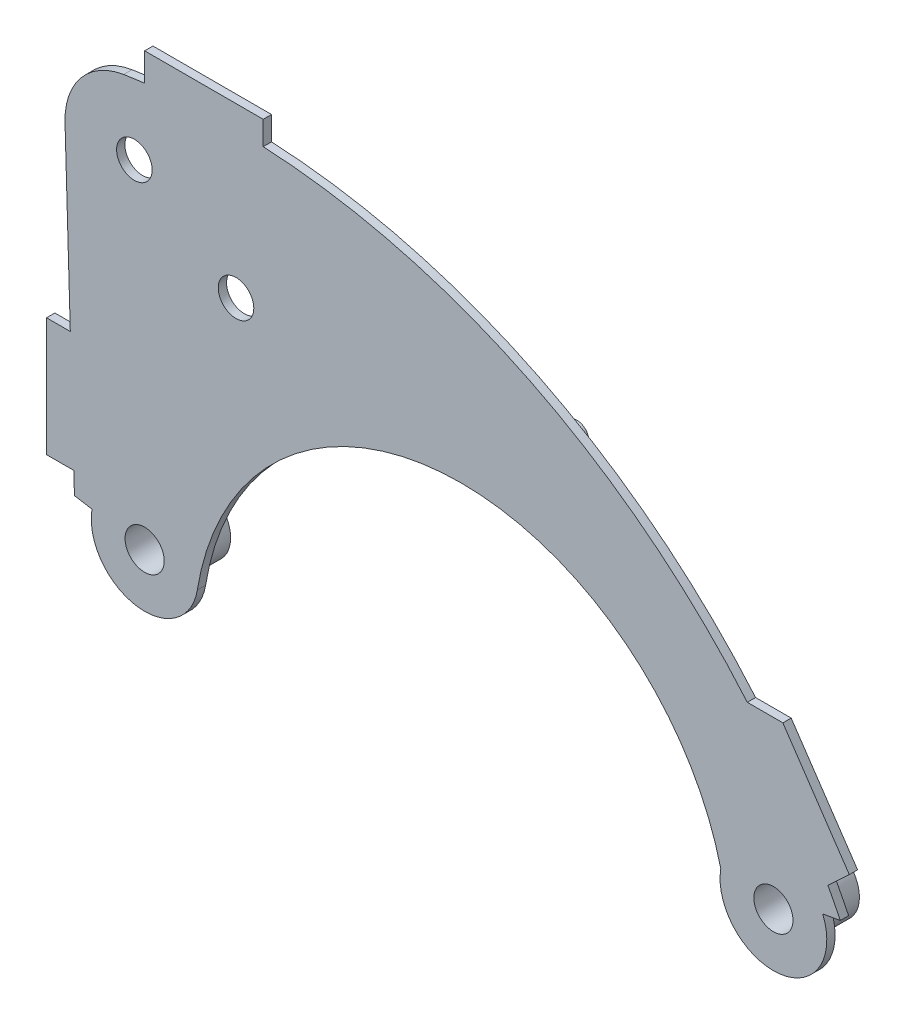
ISO-10303-21;
HEADER;
FILE_DESCRIPTION(('STEP AP214'),'2;1');
FILE_NAME('part.step','',(''),(''),'','','');
FILE_SCHEMA(('AUTOMOTIVE_DESIGN { 1 0 10303 214 1 1 1 1 }'));
ENDSEC;
DATA;
#1=APPLICATION_CONTEXT('core data for automotive mechanical design processes');
#2=APPLICATION_PROTOCOL_DEFINITION('international standard','automotive_design',2000,#1);
#3=PRODUCT_CONTEXT('',#1,'mechanical');
#4=PRODUCT('Part','Part','',(#3));
#5=PRODUCT_RELATED_PRODUCT_CATEGORY('part','',(#4));
#6=PRODUCT_DEFINITION_FORMATION('','',#4);
#7=PRODUCT_DEFINITION_CONTEXT('part definition',#1,'design');
#8=PRODUCT_DEFINITION('design','',#6,#7);
#9=PRODUCT_DEFINITION_SHAPE('','',#8);
#10=(LENGTH_UNIT() NAMED_UNIT(*) SI_UNIT(.MILLI.,.METRE.));
#11=(NAMED_UNIT(*) PLANE_ANGLE_UNIT() SI_UNIT($,.RADIAN.));
#12=(NAMED_UNIT(*) SI_UNIT($,.STERADIAN.) SOLID_ANGLE_UNIT());
#13=UNCERTAINTY_MEASURE_WITH_UNIT(LENGTH_MEASURE(1.E-05),#10,'distance_accuracy_value','');
#14=(GEOMETRIC_REPRESENTATION_CONTEXT(3) GLOBAL_UNCERTAINTY_ASSIGNED_CONTEXT((#13)) GLOBAL_UNIT_ASSIGNED_CONTEXT((#10,
#11,#12)) REPRESENTATION_CONTEXT('',''));
#15=CARTESIAN_POINT('',(0.,0.,0.));
#16=DIRECTION('',(0.,0.,1.));
#17=DIRECTION('',(1.,0.,0.));
#18=AXIS2_PLACEMENT_3D('',#15,#16,#17);
#19=CARTESIAN_POINT('',(-192.707076218779,-184.284598923351,7.));
#20=DIRECTION('',(0.,0.,-1.));
#21=DIRECTION('',(-1.,0.,0.));
#22=AXIS2_PLACEMENT_3D('',#19,#20,#21);
#23=CYLINDRICAL_SURFACE('',#22,573.469503846789);
#24=CARTESIAN_POINT('',(-192.707076218779,-184.284598923351,7.));
#25=DIRECTION('',(0.,0.,1.));
#26=DIRECTION('',(1.,0.,0.));
#27=AXIS2_PLACEMENT_3D('',#24,#25,#26);
#28=CIRCLE('',#27,573.469503846789);
#29=CARTESIAN_POINT('',(-263.634141290902,384.781849993238,7.00000000000001));
#30=VERTEX_POINT('',#29);
#31=CARTESIAN_POINT('',(-281.327086526287,382.296168148193,7.));
#32=VERTEX_POINT('',#31);
#33=EDGE_CURVE('E345',#30,#32,#28,.T.);
#34=ORIENTED_EDGE('',*,*,#33,.F.);
#35=DIRECTION('',(0.,0.,-1.));
#36=VECTOR('',#35,1.);
#37=CARTESIAN_POINT('',(-263.634141290902,384.781849993238,7.));
#38=LINE('',#37,#36);
#39=CARTESIAN_POINT('',(-263.634141290902,384.781849993238,0.));
#40=VERTEX_POINT('',#39);
#41=EDGE_CURVE('E199',#30,#40,#38,.T.);
#42=ORIENTED_EDGE('',*,*,#41,.T.);
#43=CARTESIAN_POINT('',(-192.707076218779,-184.284598923351,0.));
#44=DIRECTION('',(0.,0.,1.));
#45=DIRECTION('',(1.,0.,0.));
#46=AXIS2_PLACEMENT_3D('',#43,#44,#45);
#47=CIRCLE('',#46,573.469503846789);
#48=CARTESIAN_POINT('',(-281.327086526287,382.296168148193,0.));
#49=VERTEX_POINT('',#48);
#50=EDGE_CURVE('E391',#40,#49,#47,.T.);
#51=ORIENTED_EDGE('',*,*,#50,.T.);
#52=DIRECTION('',(0.,0.,-1.));
#53=VECTOR('',#52,1.);
#54=CARTESIAN_POINT('',(-281.327086526287,382.296168148193,7.));
#55=LINE('',#54,#53);
#56=EDGE_CURVE('E449',#32,#49,#55,.T.);
#57=ORIENTED_EDGE('',*,*,#56,.F.);
#58=EDGE_LOOP('',(#34,#42,#51,#57));
#59=FACE_BOUND('',#58,.T.);
#60=ADVANCED_FACE('F41',(#59),#23,.T.);
#61=CARTESIAN_POINT('',(-320.932430468004,-9.49371903301343,7.));
#62=DIRECTION('',(-0.999562749185393,-0.0295687409427409,0.));
#63=DIRECTION('',(0.0295687409427409,-0.999562749185393,0.));
#64=AXIS2_PLACEMENT_3D('',#61,#62,#63);
#65=PLANE('',#64);
#66=DIRECTION('',(0.,0.,-1.));
#67=VECTOR('',#66,1.);
#68=CARTESIAN_POINT('',(-323.347893363287,72.1603066436242,109.601547052196));
#69=LINE('',#68,#67);
#70=CARTESIAN_POINT('',(-323.347893363287,72.1603066436242,7.00000000000001));
#71=VERTEX_POINT('',#70);
#72=CARTESIAN_POINT('',(-323.347893363287,72.1603066436242,0.));
#73=VERTEX_POINT('',#72);
#74=EDGE_CURVE('E250',#71,#73,#69,.T.);
#75=ORIENTED_EDGE('',*,*,#74,.T.);
#76=DIRECTION('',(-0.0295687409427408,0.999562749185393,0.));
#77=VECTOR('',#76,1.);
#78=CARTESIAN_POINT('',(-320.932430468004,-9.49371903301343,0.));
#79=LINE('',#78,#77);
#80=CARTESIAN_POINT('',(-322.811275447721,54.0200929637776,0.));
#81=VERTEX_POINT('',#80);
#82=EDGE_CURVE('E401',#81,#73,#79,.T.);
#83=ORIENTED_EDGE('',*,*,#82,.F.);
#84=DIRECTION('',(0.,0.,-1.));
#85=VECTOR('',#84,1.);
#86=CARTESIAN_POINT('',(-322.811275447721,54.0200929637776,7.));
#87=LINE('',#86,#85);
#88=CARTESIAN_POINT('',(-322.811275447721,54.0200929637776,7.));
#89=VERTEX_POINT('',#88);
#90=EDGE_CURVE('E442',#89,#81,#87,.T.);
#91=ORIENTED_EDGE('',*,*,#90,.F.);
#92=DIRECTION('',(-0.0295687409427408,0.999562749185393,0.));
#93=VECTOR('',#92,1.);
#94=CARTESIAN_POINT('',(-320.932430468004,-9.49371903301343,7.));
#95=LINE('',#94,#93);
#96=EDGE_CURVE('E356',#89,#71,#95,.T.);
#97=ORIENTED_EDGE('',*,*,#96,.T.);
#98=EDGE_LOOP('',(#75,#83,#91,#97));
#99=FACE_BOUND('',#98,.T.);
#100=ADVANCED_FACE('F505',(#99),#65,.T.);
#101=CARTESIAN_POINT('',(244.528320180964,186.784774614053,0.));
#102=VERTEX_POINT('',#101);
#103=CARTESIAN_POINT('',(-163.634141290902,388.44748180634,0.));
#104=VERTEX_POINT('',#103);
#105=EDGE_CURVE('E396',#102,#104,#47,.T.);
#106=ORIENTED_EDGE('',*,*,#105,.T.);
#107=DIRECTION('',(0.,0.,-1.));
#108=VECTOR('',#107,1.);
#109=CARTESIAN_POINT('',(-163.634141290902,388.44748180634,109.904064373315));
#110=LINE('',#109,#108);
#111=CARTESIAN_POINT('',(-163.634141290901,388.44748180634,7.));
#112=VERTEX_POINT('',#111);
#113=EDGE_CURVE('E225',#112,#104,#110,.T.);
#114=ORIENTED_EDGE('',*,*,#113,.F.);
#115=CARTESIAN_POINT('',(244.528320180963,186.784774614054,7.00000000000001));
#116=VERTEX_POINT('',#115);
#117=EDGE_CURVE('E351',#116,#112,#28,.T.);
#118=ORIENTED_EDGE('',*,*,#117,.F.);
#119=DIRECTION('',(0.,0.,-1.));
#120=VECTOR('',#119,1.);
#121=CARTESIAN_POINT('',(244.528320180963,186.784774614054,138.898143616033));
#122=LINE('',#121,#120);
#123=EDGE_CURVE('E277',#116,#102,#122,.T.);
#124=ORIENTED_EDGE('',*,*,#123,.T.);
#125=EDGE_LOOP('',(#106,#114,#118,#124));
#126=FACE_BOUND('',#125,.T.);
#127=ADVANCED_FACE('F508',(#126),#23,.T.);
#128=CARTESIAN_POINT('',(-1.74396232257102,9.99269328968787,7.));
#129=DIRECTION('',(-0.171925097366177,0.985110024766589,0.));
#130=DIRECTION('',(-0.98511002476659,-0.171925097366177,0.));
#131=AXIS2_PLACEMENT_3D('',#128,#129,#130);
#132=PLANE('',#131);
#133=DIRECTION('',(0.985110024766589,0.171925097366177,0.));
#134=VECTOR('',#133,1.);
#135=CARTESIAN_POINT('',(-1.74396232257102,9.99269328968787,0.));
#136=LINE('',#135,#134);
#137=CARTESIAN_POINT('',(308.11587010362,64.0705937479262,0.));
#138=VERTEX_POINT('',#137);
#139=CARTESIAN_POINT('',(322.942948353425,66.6582710709314,0.));
#140=VERTEX_POINT('',#139);
#141=EDGE_CURVE('E387',#138,#140,#136,.T.);
#142=ORIENTED_EDGE('',*,*,#141,.T.);
#143=DIRECTION('',(0.,0.,-1.));
#144=VECTOR('',#143,1.);
#145=CARTESIAN_POINT('',(322.942948353425,66.6582710709314,7.));
#146=LINE('',#145,#144);
#147=CARTESIAN_POINT('',(322.942948353425,66.6582710709314,7.));
#148=VERTEX_POINT('',#147);
#149=EDGE_CURVE('E453',#148,#140,#146,.T.);
#150=ORIENTED_EDGE('',*,*,#149,.F.);
#151=DIRECTION('',(0.985110024766589,0.171925097366177,0.));
#152=VECTOR('',#151,1.);
#153=CARTESIAN_POINT('',(-1.74396232257102,9.99269328968787,7.));
#154=LINE('',#153,#152);
#155=CARTESIAN_POINT('',(308.11587010362,64.0705937479262,7.));
#156=VERTEX_POINT('',#155);
#157=EDGE_CURVE('E341',#156,#148,#154,.T.);
#158=ORIENTED_EDGE('',*,*,#157,.F.);
#159=DIRECTION('',(0.,0.,-1.));
#160=VECTOR('',#159,1.);
#161=CARTESIAN_POINT('',(308.11587010362,64.0705937479262,7.));
#162=LINE('',#161,#160);
#163=EDGE_CURVE('E378',#156,#138,#162,.T.);
#164=ORIENTED_EDGE('',*,*,#163,.T.);
#165=EDGE_LOOP('',(#142,#150,#158,#164));
#166=FACE_BOUND('',#165,.T.);
#167=ADVANCED_FACE('F518',(#166),#132,.F.);
#168=CARTESIAN_POINT('',(312.479281407487,87.1081347866523,0.));
#169=VERTEX_POINT('',#168);
#170=EDGE_CURVE('E392',#140,#169,#47,.T.);
#171=ORIENTED_EDGE('',*,*,#170,.T.);
#172=DIRECTION('',(0.,0.,-1.));
#173=VECTOR('',#172,1.);
#174=CARTESIAN_POINT('',(312.479281407487,87.1081347866523,7.));
#175=LINE('',#174,#173);
#176=CARTESIAN_POINT('',(312.479281407487,87.1081347866523,7.));
#177=VERTEX_POINT('',#176);
#178=EDGE_CURVE('E291',#169,#177,#175,.F.);
#179=ORIENTED_EDGE('',*,*,#178,.T.);
#180=EDGE_CURVE('E346',#148,#177,#28,.T.);
#181=ORIENTED_EDGE('',*,*,#180,.F.);
#182=ORIENTED_EDGE('',*,*,#149,.T.);
#183=EDGE_LOOP('',(#171,#179,#181,#182));
#184=FACE_BOUND('',#183,.T.);
#185=ADVANCED_FACE('F509',(#184),#23,.T.);
#186=CARTESIAN_POINT('',(-272.286901183886,324.498892702243,7.));
#187=DIRECTION('',(0.,0.,-1.));
#188=DIRECTION('',(-1.,0.,0.));
#189=AXIS2_PLACEMENT_3D('',#186,#187,#188);
#190=CYLINDRICAL_SURFACE('',#189,58.5);
#191=CARTESIAN_POINT('',(-272.286901183886,324.498892702243,0.));
#192=DIRECTION('',(0.,0.,1.));
#193=DIRECTION('',(1.,0.,0.));
#194=AXIS2_PLACEMENT_3D('',#191,#192,#193);
#195=CIRCLE('',#194,58.5);
#196=CARTESIAN_POINT('',(-330.761322011232,322.769121357092,0.));
#197=VERTEX_POINT('',#196);
#198=EDGE_CURVE('E395',#49,#197,#195,.T.);
#199=ORIENTED_EDGE('',*,*,#198,.T.);
#200=DIRECTION('',(0.,0.,-1.));
#201=VECTOR('',#200,1.);
#202=CARTESIAN_POINT('',(-330.761322011232,322.769121357092,7.));
#203=LINE('',#202,#201);
#204=CARTESIAN_POINT('',(-330.761322011232,322.769121357092,7.));
#205=VERTEX_POINT('',#204);
#206=EDGE_CURVE('E445',#205,#197,#203,.T.);
#207=ORIENTED_EDGE('',*,*,#206,.F.);
#208=CARTESIAN_POINT('',(-272.286901183886,324.498892702243,7.));
#209=DIRECTION('',(0.,0.,1.));
#210=DIRECTION('',(1.,0.,0.));
#211=AXIS2_PLACEMENT_3D('',#208,#209,#210);
#212=CIRCLE('',#211,58.5);
#213=EDGE_CURVE('E350',#32,#205,#212,.T.);
#214=ORIENTED_EDGE('',*,*,#213,.F.);
#215=ORIENTED_EDGE('',*,*,#56,.T.);
#216=EDGE_LOOP('',(#199,#207,#214,#215));
#217=FACE_BOUND('',#216,.T.);
#218=ADVANCED_FACE('F521',(#217),#190,.T.);
#219=DIRECTION('',(0.,0.,-1.));
#220=VECTOR('',#219,1.);
#221=CARTESIAN_POINT('',(-326.306060918734,172.160306643624,109.601547052196));
#222=LINE('',#221,#220);
#223=CARTESIAN_POINT('',(-326.306060918734,172.160306643624,7.00000000000001));
#224=VERTEX_POINT('',#223);
#225=CARTESIAN_POINT('',(-326.306060918734,172.160306643624,0.));
#226=VERTEX_POINT('',#225);
#227=EDGE_CURVE('E242',#224,#226,#222,.T.);
#228=ORIENTED_EDGE('',*,*,#227,.F.);
#229=EDGE_CURVE('E355',#224,#205,#95,.T.);
#230=ORIENTED_EDGE('',*,*,#229,.T.);
#231=ORIENTED_EDGE('',*,*,#206,.T.);
#232=EDGE_CURVE('E400',#226,#197,#79,.T.);
#233=ORIENTED_EDGE('',*,*,#232,.F.);
#234=EDGE_LOOP('',(#228,#230,#231,#233));
#235=FACE_BOUND('',#234,.T.);
#236=ADVANCED_FACE('F515',(#235),#65,.T.);
#237=CARTESIAN_POINT('',(-8.62227936014492E-06,-5.15246478796E-05,7.));
#238=DIRECTION('',(-0.165047798620306,-0.986285569280313,0.));
#239=DIRECTION('',(0.986285569280313,-0.165047798620306,0.));
#240=AXIS2_PLACEMENT_3D('',#237,#238,#239);
#241=PLANE('',#240);
#242=DIRECTION('',(-0.986285569280313,0.165047798620306,0.));
#243=VECTOR('',#242,1.);
#244=CARTESIAN_POINT('',(-8.62227936014492E-06,-5.15246478796E-05,0.));
#245=LINE('',#244,#243);
#246=CARTESIAN_POINT('',(-308.016991908516,51.544375984473,0.));
#247=VERTEX_POINT('',#246);
#248=EDGE_CURVE('E405',#247,#81,#245,.T.);
#249=ORIENTED_EDGE('',*,*,#248,.F.);
#250=DIRECTION('',(0.,0.,-1.));
#251=VECTOR('',#250,1.);
#252=CARTESIAN_POINT('',(-308.016991908516,51.544375984473,7.));
#253=LINE('',#252,#251);
#254=CARTESIAN_POINT('',(-308.016991908516,51.544375984473,7.));
#255=VERTEX_POINT('',#254);
#256=EDGE_CURVE('E439',#255,#247,#253,.T.);
#257=ORIENTED_EDGE('',*,*,#256,.F.);
#258=DIRECTION('',(-0.986285569280313,0.165047798620306,0.));
#259=VECTOR('',#258,1.);
#260=CARTESIAN_POINT('',(-8.62227936014492E-06,-5.15246478796E-05,7.));
#261=LINE('',#260,#259);
#262=EDGE_CURVE('E360',#255,#89,#261,.T.);
#263=ORIENTED_EDGE('',*,*,#262,.T.);
#264=ORIENTED_EDGE('',*,*,#90,.T.);
#265=EDGE_LOOP('',(#249,#257,#263,#264));
#266=FACE_BOUND('',#265,.T.);
#267=ADVANCED_FACE('F601',(#266),#241,.T.);
#268=CARTESIAN_POINT('',(-263.634141290902,44.1172250465592,7.));
#269=DIRECTION('',(0.,0.,-1.));
#270=DIRECTION('',(-1.,0.,0.));
#271=AXIS2_PLACEMENT_3D('',#268,#269,#270);
#272=CYLINDRICAL_SURFACE('',#271,44.9999999999999);
#273=CARTESIAN_POINT('',(-263.634141290902,44.1172250465592,0.));
#274=DIRECTION('',(0.,0.,1.));
#275=DIRECTION('',(1.,0.,0.));
#276=AXIS2_PLACEMENT_3D('',#273,#274,#275);
#277=CIRCLE('',#276,44.9999999999999);
#278=CARTESIAN_POINT('',(-263.634141290902,-0.882774953440794,0.));
#279=VERTEX_POINT('',#278);
#280=EDGE_CURVE('E409',#247,#279,#277,.T.);
#281=ORIENTED_EDGE('',*,*,#280,.T.);
#282=DIRECTION('',(0.,0.,-1.));
#283=VECTOR('',#282,1.);
#284=CARTESIAN_POINT('',(-263.634141290902,-0.882774953440794,7.));
#285=LINE('',#284,#283);
#286=CARTESIAN_POINT('',(-263.634141290902,-0.882774953440794,7.));
#287=VERTEX_POINT('',#286);
#288=EDGE_CURVE('E435',#287,#279,#285,.T.);
#289=ORIENTED_EDGE('',*,*,#288,.F.);
#290=CARTESIAN_POINT('',(-263.634141290902,44.1172250465592,7.));
#291=DIRECTION('',(0.,0.,1.));
#292=DIRECTION('',(1.,0.,0.));
#293=AXIS2_PLACEMENT_3D('',#290,#291,#292);
#294=CIRCLE('',#293,44.9999999999999);
#295=EDGE_CURVE('E364',#255,#287,#294,.T.);
#296=ORIENTED_EDGE('',*,*,#295,.F.);
#297=ORIENTED_EDGE('',*,*,#256,.T.);
#298=EDGE_LOOP('',(#281,#289,#296,#297));
#299=FACE_BOUND('',#298,.T.);
#300=ADVANCED_FACE('F679',(#299),#272,.T.);
#301=CARTESIAN_POINT('',(-0.0073422157700782,1.0182110112859,7.));
#302=DIRECTION('',(-0.00721071055936465,0.999974002488679,0.));
#303=DIRECTION('',(-0.999974002488679,-0.00721071055936465,0.));
#304=AXIS2_PLACEMENT_3D('',#301,#302,#303);
#305=PLANE('',#304);
#306=DIRECTION('',(0.999974002488679,0.00721071055936465,0.));
#307=VECTOR('',#306,1.);
#308=CARTESIAN_POINT('',(-0.0073422157700782,1.0182110112859,0.));
#309=LINE('',#308,#307);
#310=CARTESIAN_POINT('',(-262.985194212018,-0.878095462231509,0.));
#311=VERTEX_POINT('',#310);
#312=EDGE_CURVE('E412',#279,#311,#309,.T.);
#313=ORIENTED_EDGE('',*,*,#312,.T.);
#314=DIRECTION('',(0.,0.,-1.));
#315=VECTOR('',#314,1.);
#316=CARTESIAN_POINT('',(-262.985194212018,-0.878095462231509,7.));
#317=LINE('',#316,#315);
#318=CARTESIAN_POINT('',(-262.985194212018,-0.878095462231509,7.));
#319=VERTEX_POINT('',#318);
#320=EDGE_CURVE('E431',#319,#311,#317,.T.);
#321=ORIENTED_EDGE('',*,*,#320,.F.);
#322=DIRECTION('',(0.999974002488679,0.00721071055936465,0.));
#323=VECTOR('',#322,1.);
#324=CARTESIAN_POINT('',(-0.0073422157700782,1.0182110112859,7.));
#325=LINE('',#324,#323);
#326=EDGE_CURVE('E367',#287,#319,#325,.T.);
#327=ORIENTED_EDGE('',*,*,#326,.F.);
#328=ORIENTED_EDGE('',*,*,#288,.T.);
#329=EDGE_LOOP('',(#313,#321,#327,#328));
#330=FACE_BOUND('',#329,.T.);
#331=ADVANCED_FACE('F596',(#330),#305,.F.);
#332=CARTESIAN_POINT('',(-219.209238470738,36.9458925749064,0.));
#333=VERTEX_POINT('',#332);
#334=EDGE_CURVE('E413',#311,#333,#277,.T.);
#335=ORIENTED_EDGE('',*,*,#334,.T.);
#336=DIRECTION('',(0.,0.,-1.));
#337=VECTOR('',#336,1.);
#338=CARTESIAN_POINT('',(-219.209238470738,36.9458925749064,7.));
#339=LINE('',#338,#337);
#340=CARTESIAN_POINT('',(-219.209238470738,36.9458925749064,7.));
#341=VERTEX_POINT('',#340);
#342=EDGE_CURVE('E428',#341,#333,#339,.T.);
#343=ORIENTED_EDGE('',*,*,#342,.F.);
#344=EDGE_CURVE('E368',#319,#341,#294,.T.);
#345=ORIENTED_EDGE('',*,*,#344,.F.);
#346=ORIENTED_EDGE('',*,*,#320,.T.);
#347=EDGE_LOOP('',(#335,#343,#345,#346));
#348=FACE_BOUND('',#347,.T.);
#349=ADVANCED_FACE('F500',(#348),#272,.T.);
#350=CARTESIAN_POINT('',(3.21144164888322,1.04142133349768,7.));
#351=DIRECTION('',(0.,0.,-1.));
#352=DIRECTION('',(-1.,0.,0.));
#353=AXIS2_PLACEMENT_3D('',#350,#351,#352);
#354=CYLINDRICAL_SURFACE('',#353,225.3);
#355=CARTESIAN_POINT('',(3.21144164888322,1.04142133349768,0.));
#356=DIRECTION('',(0.,0.,1.));
#357=DIRECTION('',(1.,0.,0.));
#358=AXIS2_PLACEMENT_3D('',#355,#356,#357);
#359=CIRCLE('',#358,225.3);
#360=CARTESIAN_POINT('',(222.170009850152,54.1190570311286,0.));
#361=VERTEX_POINT('',#360);
#362=EDGE_CURVE('E416',#361,#333,#359,.T.);
#363=ORIENTED_EDGE('',*,*,#362,.F.);
#364=DIRECTION('',(0.,0.,-1.));
#365=VECTOR('',#364,1.);
#366=CARTESIAN_POINT('',(222.170009850152,54.1190570311286,7.));
#367=LINE('',#366,#365);
#368=CARTESIAN_POINT('',(222.170009850152,54.1190570311286,7.));
#369=VERTEX_POINT('',#368);
#370=EDGE_CURVE('E425',#369,#361,#367,.T.);
#371=ORIENTED_EDGE('',*,*,#370,.F.);
#372=CARTESIAN_POINT('',(3.21144164888322,1.04142133349768,7.));
#373=DIRECTION('',(0.,0.,1.));
#374=DIRECTION('',(1.,0.,0.));
#375=AXIS2_PLACEMENT_3D('',#372,#373,#374);
#376=CIRCLE('',#375,225.3);
#377=EDGE_CURVE('E371',#369,#341,#376,.T.);
#378=ORIENTED_EDGE('',*,*,#377,.T.);
#379=ORIENTED_EDGE('',*,*,#342,.T.);
#380=EDGE_LOOP('',(#363,#371,#378,#379));
#381=FACE_BOUND('',#380,.T.);
#382=ADVANCED_FACE('F490',(#381),#354,.F.);
#383=CARTESIAN_POINT('',(-272.286901183886,324.498892702243,7.));
#384=DIRECTION('',(0.,0.,-1.));
#385=DIRECTION('',(-1.,0.,0.));
#386=AXIS2_PLACEMENT_3D('',#383,#384,#385);
#387=CYLINDRICAL_SURFACE('',#386,15.);
#388=CARTESIAN_POINT('',(-272.286901183886,324.498892702243,7.));
#389=DIRECTION('',(0.,0.,1.));
#390=DIRECTION('',(1.,0.,0.));
#391=AXIS2_PLACEMENT_3D('',#388,#389,#390);
#392=CIRCLE('',#391,15.);
#393=CARTESIAN_POINT('',(-257.286901183886,324.498892702243,7.));
#394=VERTEX_POINT('',#393);
#395=EDGE_CURVE('E337',#394,#394,#392,.T.);
#396=ORIENTED_EDGE('',*,*,#395,.T.);
#397=EDGE_LOOP('',(#396));
#398=FACE_BOUND('',#397,.T.);
#399=CARTESIAN_POINT('',(-272.286901183886,324.498892702243,0.));
#400=DIRECTION('',(0.,0.,1.));
#401=DIRECTION('',(1.,0.,0.));
#402=AXIS2_PLACEMENT_3D('',#399,#400,#401);
#403=CIRCLE('',#402,15.);
#404=CARTESIAN_POINT('',(-257.286901183886,324.498892702243,0.));
#405=VERTEX_POINT('',#404);
#406=EDGE_CURVE('E383',#405,#405,#403,.T.);
#407=ORIENTED_EDGE('',*,*,#406,.F.);
#408=EDGE_LOOP('',(#407));
#409=FACE_BOUND('',#408,.T.);
#410=ADVANCED_FACE('F487',(#398,#409),#387,.F.);
#411=CARTESIAN_POINT('',(266.568301500018,46.7847746140535,7.));
#412=DIRECTION('',(0.,0.,-1.));
#413=DIRECTION('',(-1.,0.,0.));
#414=AXIS2_PLACEMENT_3D('',#411,#412,#413);
#415=CYLINDRICAL_SURFACE('',#414,16.5000000000001);
#416=CARTESIAN_POINT('',(266.568301500018,46.7847746140535,7.));
#417=DIRECTION('',(0.,0.,1.));
#418=DIRECTION('',(1.,0.,0.));
#419=AXIS2_PLACEMENT_3D('',#416,#417,#418);
#420=CIRCLE('',#419,16.5000000000001);
#421=CARTESIAN_POINT('',(283.068301500018,46.7847746140535,7.));
#422=VERTEX_POINT('',#421);
#423=EDGE_CURVE('E333',#422,#422,#420,.T.);
#424=ORIENTED_EDGE('',*,*,#423,.T.);
#425=EDGE_LOOP('',(#424));
#426=FACE_BOUND('',#425,.T.);
#427=CARTESIAN_POINT('',(266.568301500018,46.7847746140535,-38.));
#428=DIRECTION('',(0.,0.,1.));
#429=DIRECTION('',(1.,0.,0.));
#430=AXIS2_PLACEMENT_3D('',#427,#428,#429);
#431=CIRCLE('',#430,16.5000000000001);
#432=CARTESIAN_POINT('',(283.068301500018,46.7847746140535,-38.));
#433=VERTEX_POINT('',#432);
#434=EDGE_CURVE('E306',#433,#433,#431,.T.);
#435=ORIENTED_EDGE('',*,*,#434,.F.);
#436=EDGE_LOOP('',(#435));
#437=FACE_BOUND('',#436,.T.);
#438=ADVANCED_FACE('F489',(#426,#437),#415,.F.);
#439=CARTESIAN_POINT('',(-263.634141290902,44.1172250465592,7.));
#440=DIRECTION('',(0.,0.,-1.));
#441=DIRECTION('',(-1.,0.,0.));
#442=AXIS2_PLACEMENT_3D('',#439,#440,#441);
#443=CYLINDRICAL_SURFACE('',#442,16.5);
#444=CARTESIAN_POINT('',(-263.634141290902,44.1172250465592,7.));
#445=DIRECTION('',(0.,0.,1.));
#446=DIRECTION('',(1.,0.,0.));
#447=AXIS2_PLACEMENT_3D('',#444,#445,#446);
#448=CIRCLE('',#447,16.5);
#449=CARTESIAN_POINT('',(-247.134141290902,44.1172250465592,7.));
#450=VERTEX_POINT('',#449);
#451=EDGE_CURVE('E328',#450,#450,#448,.T.);
#452=ORIENTED_EDGE('',*,*,#451,.T.);
#453=EDGE_LOOP('',(#452));
#454=FACE_BOUND('',#453,.T.);
#455=CARTESIAN_POINT('',(-263.634141290902,44.1172250465592,-38.));
#456=DIRECTION('',(0.,0.,1.));
#457=DIRECTION('',(1.,0.,0.));
#458=AXIS2_PLACEMENT_3D('',#455,#456,#457);
#459=CIRCLE('',#458,16.5);
#460=CARTESIAN_POINT('',(-247.134141290902,44.1172250465592,-38.));
#461=VERTEX_POINT('',#460);
#462=EDGE_CURVE('E315',#461,#461,#459,.T.);
#463=ORIENTED_EDGE('',*,*,#462,.F.);
#464=EDGE_LOOP('',(#463));
#465=FACE_BOUND('',#464,.T.);
#466=ADVANCED_FACE('F497',(#454,#465),#443,.F.);
#467=CARTESIAN_POINT('',(-186.584414744995,266.470160007209,7.));
#468=DIRECTION('',(0.,0.,-1.));
#469=DIRECTION('',(-1.,0.,0.));
#470=AXIS2_PLACEMENT_3D('',#467,#468,#469);
#471=CYLINDRICAL_SURFACE('',#470,15.);
#472=CARTESIAN_POINT('',(-186.584414744995,266.470160007209,7.));
#473=DIRECTION('',(0.,0.,1.));
#474=DIRECTION('',(1.,0.,0.));
#475=AXIS2_PLACEMENT_3D('',#472,#473,#474);
#476=CIRCLE('',#475,15.);
#477=CARTESIAN_POINT('',(-171.584414744995,266.470160007209,7.));
#478=VERTEX_POINT('',#477);
#479=EDGE_CURVE('E324',#478,#478,#476,.T.);
#480=ORIENTED_EDGE('',*,*,#479,.T.);
#481=EDGE_LOOP('',(#480));
#482=FACE_BOUND('',#481,.T.);
#483=CARTESIAN_POINT('',(-186.584414744995,266.470160007209,0.));
#484=DIRECTION('',(0.,0.,1.));
#485=DIRECTION('',(1.,0.,0.));
#486=AXIS2_PLACEMENT_3D('',#483,#484,#485);
#487=CIRCLE('',#486,15.);
#488=CARTESIAN_POINT('',(-171.584414744995,266.470160007209,0.));
#489=VERTEX_POINT('',#488);
#490=EDGE_CURVE('E379',#489,#489,#487,.T.);
#491=ORIENTED_EDGE('',*,*,#490,.F.);
#492=EDGE_LOOP('',(#491));
#493=FACE_BOUND('',#492,.T.);
#494=ADVANCED_FACE('F43',(#482,#493),#471,.F.);
#495=CARTESIAN_POINT('',(266.568301500018,46.7847746140535,7.));
#496=DIRECTION('',(0.,0.,-1.));
#497=DIRECTION('',(-1.,0.,0.));
#498=AXIS2_PLACEMENT_3D('',#495,#496,#497);
#499=CYLINDRICAL_SURFACE('',#498,45.);
#500=CARTESIAN_POINT('',(266.568301500018,46.7847746140535,0.));
#501=DIRECTION('',(0.,0.,1.));
#502=DIRECTION('',(1.,0.,0.));
#503=AXIS2_PLACEMENT_3D('',#500,#501,#502);
#504=CIRCLE('',#503,45.);
#505=EDGE_CURVE('E329',#361,#138,#504,.T.);
#506=ORIENTED_EDGE('',*,*,#505,.T.);
#507=ORIENTED_EDGE('',*,*,#163,.F.);
#508=CARTESIAN_POINT('',(266.568301500018,46.7847746140535,7.));
#509=DIRECTION('',(0.,0.,1.));
#510=DIRECTION('',(1.,0.,0.));
#511=AXIS2_PLACEMENT_3D('',#508,#509,#510);
#512=CIRCLE('',#511,45.);
#513=EDGE_CURVE('E375',#369,#156,#512,.T.);
#514=ORIENTED_EDGE('',*,*,#513,.F.);
#515=ORIENTED_EDGE('',*,*,#370,.T.);
#516=EDGE_LOOP('',(#506,#507,#514,#515));
#517=FACE_BOUND('',#516,.T.);
#518=ADVANCED_FACE('F673',(#517),#499,.T.);
#519=CARTESIAN_POINT('',(0.,0.,7.));
#520=DIRECTION('',(0.,0.,1.));
#521=DIRECTION('',(1.,0.,0.));
#522=AXIS2_PLACEMENT_3D('',#519,#520,#521);
#523=PLANE('',#522);
#524=ORIENTED_EDGE('',*,*,#117,.T.);
#525=DIRECTION('',(0.,-1.,0.));
#526=VECTOR('',#525,1.);
#527=CARTESIAN_POINT('',(-163.634141290902,388.44748180634,7.00000000000001));
#528=LINE('',#527,#526);
#529=CARTESIAN_POINT('',(-163.634141290902,408.44748180634,7.00000000000001));
#530=VERTEX_POINT('',#529);
#531=EDGE_CURVE('E57',#530,#112,#528,.T.);
#532=ORIENTED_EDGE('',*,*,#531,.F.);
#533=DIRECTION('',(1.,0.,0.));
#534=VECTOR('',#533,1.);
#535=CARTESIAN_POINT('',(-163.634141290902,408.44748180634,7.00000000000001));
#536=LINE('',#535,#534);
#537=CARTESIAN_POINT('',(-263.634141290902,408.44748180634,7.00000000000001));
#538=VERTEX_POINT('',#537);
#539=EDGE_CURVE('E206',#538,#530,#536,.T.);
#540=ORIENTED_EDGE('',*,*,#539,.F.);
#541=DIRECTION('',(0.,1.,0.));
#542=VECTOR('',#541,1.);
#543=CARTESIAN_POINT('',(-263.634141290902,384.173082441016,7.00000000000001));
#544=LINE('',#543,#542);
#545=EDGE_CURVE('E192',#30,#538,#544,.T.);
#546=ORIENTED_EDGE('',*,*,#545,.F.);
#547=ORIENTED_EDGE('',*,*,#33,.T.);
#548=ORIENTED_EDGE('',*,*,#213,.T.);
#549=ORIENTED_EDGE('',*,*,#229,.F.);
#550=DIRECTION('',(1.,0.,0.));
#551=VECTOR('',#550,1.);
#552=CARTESIAN_POINT('',(-326.306060918734,172.160306643624,7.00000000000001));
#553=LINE('',#552,#551);
#554=CARTESIAN_POINT('',(-346.306060918734,172.160306643624,7.00000000000001));
#555=VERTEX_POINT('',#554);
#556=EDGE_CURVE('E239',#555,#224,#553,.T.);
#557=ORIENTED_EDGE('',*,*,#556,.F.);
#558=DIRECTION('',(0.,1.,0.));
#559=VECTOR('',#558,1.);
#560=CARTESIAN_POINT('',(-346.306060918734,172.160306643624,7.00000000000001));
#561=LINE('',#560,#559);
#562=CARTESIAN_POINT('',(-346.306060918734,72.1603066436242,7.00000000000001));
#563=VERTEX_POINT('',#562);
#564=EDGE_CURVE('E244',#563,#555,#561,.T.);
#565=ORIENTED_EDGE('',*,*,#564,.F.);
#566=DIRECTION('',(-1.,0.,0.));
#567=VECTOR('',#566,1.);
#568=CARTESIAN_POINT('',(-346.306060918734,72.1603066436242,7.00000000000001));
#569=LINE('',#568,#567);
#570=EDGE_CURVE('E228',#71,#563,#569,.T.);
#571=ORIENTED_EDGE('',*,*,#570,.F.);
#572=ORIENTED_EDGE('',*,*,#96,.F.);
#573=ORIENTED_EDGE('',*,*,#262,.F.);
#574=ORIENTED_EDGE('',*,*,#295,.T.);
#575=ORIENTED_EDGE('',*,*,#326,.T.);
#576=ORIENTED_EDGE('',*,*,#344,.T.);
#577=ORIENTED_EDGE('',*,*,#377,.F.);
#578=ORIENTED_EDGE('',*,*,#513,.T.);
#579=ORIENTED_EDGE('',*,*,#157,.T.);
#580=ORIENTED_EDGE('',*,*,#180,.T.);
#581=DIRECTION('',(-0.731460638202026,-0.681883666589166,0.));
#582=VECTOR('',#581,1.);
#583=CARTESIAN_POINT('',(330.534833244543,103.939916629631,7.00000000000001));
#584=LINE('',#583,#582);
#585=CARTESIAN_POINT('',(330.534833244543,103.939916629631,7.00000000000001));
#586=VERTEX_POINT('',#585);
#587=EDGE_CURVE('E269',#586,#177,#584,.T.);
#588=ORIENTED_EDGE('',*,*,#587,.F.);
#589=DIRECTION('',(0.560065130635793,-0.828448579844225,0.));
#590=VECTOR('',#589,1.);
#591=CARTESIAN_POINT('',(274.528320180963,186.784774614053,7.00000000000001));
#592=LINE('',#591,#590);
#593=CARTESIAN_POINT('',(274.528320180963,186.784774614053,7.00000000000001));
#594=VERTEX_POINT('',#593);
#595=EDGE_CURVE('E263',#594,#586,#592,.T.);
#596=ORIENTED_EDGE('',*,*,#595,.F.);
#597=DIRECTION('',(-1.,0.,0.));
#598=VECTOR('',#597,1.);
#599=CARTESIAN_POINT('',(274.528320180963,186.784774614053,7.00000000000001));
#600=LINE('',#599,#598);
#601=EDGE_CURVE('E258',#594,#116,#600,.T.);
#602=ORIENTED_EDGE('',*,*,#601,.T.);
#603=EDGE_LOOP('',(#524,#532,#540,#546,#547,#548,#549,#557,#565,#571,#572,#573,#574,#575,#576,
#577,#578,#579,#580,#588,#596,#602));
#604=FACE_BOUND('',#603,.T.);
#605=ORIENTED_EDGE('',*,*,#479,.F.);
#606=EDGE_LOOP('',(#605));
#607=FACE_BOUND('',#606,.T.);
#608=ORIENTED_EDGE('',*,*,#395,.F.);
#609=EDGE_LOOP('',(#608));
#610=FACE_BOUND('',#609,.T.);
#611=ORIENTED_EDGE('',*,*,#451,.F.);
#612=EDGE_LOOP('',(#611));
#613=FACE_BOUND('',#612,.T.);
#614=ORIENTED_EDGE('',*,*,#423,.F.);
#615=EDGE_LOOP('',(#614));
#616=FACE_BOUND('',#615,.T.);
#617=ADVANCED_FACE('F208',(#604,#607,#610,#613,#616),#523,.T.);
#618=CARTESIAN_POINT('',(0.,0.,0.));
#619=DIRECTION('',(0.,0.,1.));
#620=DIRECTION('',(1.,0.,0.));
#621=AXIS2_PLACEMENT_3D('',#618,#619,#620);
#622=PLANE('',#621);
#623=ORIENTED_EDGE('',*,*,#50,.F.);
#624=DIRECTION('',(0.,1.,0.));
#625=VECTOR('',#624,1.);
#626=CARTESIAN_POINT('',(-263.634141290902,384.173082441016,0.));
#627=LINE('',#626,#625);
#628=CARTESIAN_POINT('',(-263.634141290902,408.44748180634,0.));
#629=VERTEX_POINT('',#628);
#630=EDGE_CURVE('E571',#40,#629,#627,.T.);
#631=ORIENTED_EDGE('',*,*,#630,.T.);
#632=DIRECTION('',(1.,0.,0.));
#633=VECTOR('',#632,1.);
#634=CARTESIAN_POINT('',(-163.634141290902,408.44748180634,0.));
#635=LINE('',#634,#633);
#636=CARTESIAN_POINT('',(-163.634141290902,408.44748180634,0.));
#637=VERTEX_POINT('',#636);
#638=EDGE_CURVE('E216',#629,#637,#635,.T.);
#639=ORIENTED_EDGE('',*,*,#638,.T.);
#640=DIRECTION('',(0.,-1.,0.));
#641=VECTOR('',#640,1.);
#642=CARTESIAN_POINT('',(-163.634141290902,388.44748180634,0.));
#643=LINE('',#642,#641);
#644=EDGE_CURVE('E203',#637,#104,#643,.T.);
#645=ORIENTED_EDGE('',*,*,#644,.T.);
#646=ORIENTED_EDGE('',*,*,#105,.F.);
#647=DIRECTION('',(-1.,0.,0.));
#648=VECTOR('',#647,1.);
#649=CARTESIAN_POINT('',(274.528320180963,186.784774614053,0.));
#650=LINE('',#649,#648);
#651=CARTESIAN_POINT('',(274.528320180963,186.784774614053,0.));
#652=VERTEX_POINT('',#651);
#653=EDGE_CURVE('E259',#652,#102,#650,.T.);
#654=ORIENTED_EDGE('',*,*,#653,.F.);
#655=DIRECTION('',(0.560065130635793,-0.828448579844224,0.));
#656=VECTOR('',#655,1.);
#657=CARTESIAN_POINT('',(274.528320180963,186.784774614053,0.));
#658=LINE('',#657,#656);
#659=CARTESIAN_POINT('',(330.534833244543,103.939916629631,0.));
#660=VERTEX_POINT('',#659);
#661=EDGE_CURVE('E270',#652,#660,#658,.T.);
#662=ORIENTED_EDGE('',*,*,#661,.T.);
#663=DIRECTION('',(-0.731460638202026,-0.681883666589166,0.));
#664=VECTOR('',#663,1.);
#665=CARTESIAN_POINT('',(330.534833244543,103.939916629631,0.));
#666=LINE('',#665,#664);
#667=EDGE_CURVE('E265',#660,#169,#666,.T.);
#668=ORIENTED_EDGE('',*,*,#667,.T.);
#669=ORIENTED_EDGE('',*,*,#170,.F.);
#670=ORIENTED_EDGE('',*,*,#141,.F.);
#671=ORIENTED_EDGE('',*,*,#505,.F.);
#672=ORIENTED_EDGE('',*,*,#362,.T.);
#673=ORIENTED_EDGE('',*,*,#334,.F.);
#674=ORIENTED_EDGE('',*,*,#312,.F.);
#675=ORIENTED_EDGE('',*,*,#280,.F.);
#676=ORIENTED_EDGE('',*,*,#248,.T.);
#677=ORIENTED_EDGE('',*,*,#82,.T.);
#678=DIRECTION('',(-1.,0.,0.));
#679=VECTOR('',#678,1.);
#680=CARTESIAN_POINT('',(-346.306060918734,72.1603066436242,0.));
#681=LINE('',#680,#679);
#682=CARTESIAN_POINT('',(-346.306060918734,72.1603066436242,0.));
#683=VERTEX_POINT('',#682);
#684=EDGE_CURVE('E224',#73,#683,#681,.T.);
#685=ORIENTED_EDGE('',*,*,#684,.T.);
#686=DIRECTION('',(0.,1.,0.));
#687=VECTOR('',#686,1.);
#688=CARTESIAN_POINT('',(-346.306060918734,172.160306643624,0.));
#689=LINE('',#688,#687);
#690=CARTESIAN_POINT('',(-346.306060918734,172.160306643624,0.));
#691=VERTEX_POINT('',#690);
#692=EDGE_CURVE('E229',#683,#691,#689,.T.);
#693=ORIENTED_EDGE('',*,*,#692,.T.);
#694=DIRECTION('',(1.,0.,0.));
#695=VECTOR('',#694,1.);
#696=CARTESIAN_POINT('',(-326.306060918734,172.160306643624,0.));
#697=LINE('',#696,#695);
#698=EDGE_CURVE('E65',#691,#226,#697,.T.);
#699=ORIENTED_EDGE('',*,*,#698,.T.);
#700=ORIENTED_EDGE('',*,*,#232,.T.);
#701=ORIENTED_EDGE('',*,*,#198,.F.);
#702=EDGE_LOOP('',(#623,#631,#639,#645,#646,#654,#662,#668,#669,#670,#671,#672,#673,#674,#675,
#676,#677,#685,#693,#699,#700,#701));
#703=FACE_BOUND('',#702,.T.);
#704=CARTESIAN_POINT('',(0.,304.731170723401,0.));
#705=DIRECTION('',(0.,0.,1.));
#706=DIRECTION('',(1.,0.,0.));
#707=AXIS2_PLACEMENT_3D('',#704,#705,#706);
#708=CIRCLE('',#707,13.);
#709=CARTESIAN_POINT('',(13.,304.731170723401,0.));
#710=VERTEX_POINT('',#709);
#711=EDGE_CURVE('E11',#710,#710,#708,.F.);
#712=ORIENTED_EDGE('',*,*,#711,.F.);
#713=EDGE_LOOP('',(#712));
#714=FACE_BOUND('',#713,.T.);
#715=CARTESIAN_POINT('',(-77.0706176427493,306.793749247086,0.));
#716=DIRECTION('',(0.,0.,1.));
#717=DIRECTION('',(1.,0.,0.));
#718=AXIS2_PLACEMENT_3D('',#715,#716,#717);
#719=CIRCLE('',#718,10.);
#720=CARTESIAN_POINT('',(-67.0706176427493,306.793749247086,0.));
#721=VERTEX_POINT('',#720);
#722=EDGE_CURVE('E50',#721,#721,#719,.F.);
#723=ORIENTED_EDGE('',*,*,#722,.F.);
#724=EDGE_LOOP('',(#723));
#725=FACE_BOUND('',#724,.T.);
#726=CARTESIAN_POINT('',(73.9773509094135,283.959387959121,0.));
#727=DIRECTION('',(0.,0.,1.));
#728=DIRECTION('',(1.,0.,0.));
#729=AXIS2_PLACEMENT_3D('',#726,#727,#728);
#730=CIRCLE('',#729,10.);
#731=CARTESIAN_POINT('',(83.9773509094135,283.959387959121,0.));
#732=VERTEX_POINT('',#731);
#733=EDGE_CURVE('E457',#732,#732,#730,.F.);
#734=ORIENTED_EDGE('',*,*,#733,.F.);
#735=EDGE_LOOP('',(#734));
#736=FACE_BOUND('',#735,.T.);
#737=CARTESIAN_POINT('',(266.568301500018,46.7847746140535,0.));
#738=DIRECTION('',(0.,0.,1.));
#739=DIRECTION('',(1.,0.,0.));
#740=AXIS2_PLACEMENT_3D('',#737,#738,#739);
#741=CIRCLE('',#740,27.5);
#742=CARTESIAN_POINT('',(294.068301500018,46.7847746140535,0.));
#743=VERTEX_POINT('',#742);
#744=EDGE_CURVE('E314',#743,#743,#741,.T.);
#745=ORIENTED_EDGE('',*,*,#744,.T.);
#746=EDGE_LOOP('',(#745));
#747=FACE_BOUND('',#746,.T.);
#748=CARTESIAN_POINT('',(-263.634141290902,44.1172250465592,0.));
#749=DIRECTION('',(0.,0.,1.));
#750=DIRECTION('',(1.,0.,0.));
#751=AXIS2_PLACEMENT_3D('',#748,#749,#750);
#752=CIRCLE('',#751,27.5);
#753=CARTESIAN_POINT('',(-236.134141290902,44.1172250465592,0.));
#754=VERTEX_POINT('',#753);
#755=EDGE_CURVE('E323',#754,#754,#752,.T.);
#756=ORIENTED_EDGE('',*,*,#755,.T.);
#757=EDGE_LOOP('',(#756));
#758=FACE_BOUND('',#757,.T.);
#759=ORIENTED_EDGE('',*,*,#490,.T.);
#760=EDGE_LOOP('',(#759));
#761=FACE_BOUND('',#760,.T.);
#762=ORIENTED_EDGE('',*,*,#406,.T.);
#763=EDGE_LOOP('',(#762));
#764=FACE_BOUND('',#763,.T.);
#765=ADVANCED_FACE('F472',(#703,#714,#725,#736,#747,#758,#761,#764),#622,.F.);
#766=CARTESIAN_POINT('',(-263.634141290902,44.1172250465592,-38.));
#767=DIRECTION('',(0.,0.,1.));
#768=DIRECTION('',(1.,0.,0.));
#769=AXIS2_PLACEMENT_3D('',#766,#767,#768);
#770=CYLINDRICAL_SURFACE('',#769,27.5);
#771=CARTESIAN_POINT('',(-263.634141290902,44.1172250465592,-38.));
#772=DIRECTION('',(0.,0.,1.));
#773=DIRECTION('',(1.,0.,0.));
#774=AXIS2_PLACEMENT_3D('',#771,#772,#773);
#775=CIRCLE('',#774,27.5);
#776=CARTESIAN_POINT('',(-236.134141290902,44.1172250465592,-38.));
#777=VERTEX_POINT('',#776);
#778=EDGE_CURVE('E319',#777,#777,#775,.T.);
#779=ORIENTED_EDGE('',*,*,#778,.T.);
#780=EDGE_LOOP('',(#779));
#781=FACE_BOUND('',#780,.T.);
#782=ORIENTED_EDGE('',*,*,#755,.F.);
#783=EDGE_LOOP('',(#782));
#784=FACE_BOUND('',#783,.T.);
#785=ADVANCED_FACE('F475',(#781,#784),#770,.T.);
#786=CARTESIAN_POINT('',(-263.634141290902,44.1172250465592,-38.));
#787=DIRECTION('',(0.,0.,1.));
#788=DIRECTION('',(1.,0.,0.));
#789=AXIS2_PLACEMENT_3D('',#786,#787,#788);
#790=PLANE('',#789);
#791=ORIENTED_EDGE('',*,*,#462,.T.);
#792=EDGE_LOOP('',(#791));
#793=FACE_BOUND('',#792,.T.);
#794=ORIENTED_EDGE('',*,*,#778,.F.);
#795=EDGE_LOOP('',(#794));
#796=FACE_BOUND('',#795,.T.);
#797=ADVANCED_FACE('F664',(#793,#796),#790,.F.);
#798=CARTESIAN_POINT('',(266.568301500018,46.7847746140535,-38.));
#799=DIRECTION('',(0.,0.,1.));
#800=DIRECTION('',(1.,0.,0.));
#801=AXIS2_PLACEMENT_3D('',#798,#799,#800);
#802=CYLINDRICAL_SURFACE('',#801,27.5);
#803=CARTESIAN_POINT('',(266.568301500018,46.7847746140535,-38.));
#804=DIRECTION('',(0.,0.,1.));
#805=DIRECTION('',(1.,0.,0.));
#806=AXIS2_PLACEMENT_3D('',#803,#804,#805);
#807=CIRCLE('',#806,27.5);
#808=CARTESIAN_POINT('',(294.068301500018,46.7847746140535,-38.));
#809=VERTEX_POINT('',#808);
#810=EDGE_CURVE('E310',#809,#809,#807,.T.);
#811=ORIENTED_EDGE('',*,*,#810,.T.);
#812=EDGE_LOOP('',(#811));
#813=FACE_BOUND('',#812,.T.);
#814=ORIENTED_EDGE('',*,*,#744,.F.);
#815=EDGE_LOOP('',(#814));
#816=FACE_BOUND('',#815,.T.);
#817=ADVANCED_FACE('F660',(#813,#816),#802,.T.);
#818=CARTESIAN_POINT('',(266.568301500018,46.7847746140535,-38.));
#819=DIRECTION('',(0.,0.,1.));
#820=DIRECTION('',(1.,0.,0.));
#821=AXIS2_PLACEMENT_3D('',#818,#819,#820);
#822=PLANE('',#821);
#823=ORIENTED_EDGE('',*,*,#434,.T.);
#824=EDGE_LOOP('',(#823));
#825=FACE_BOUND('',#824,.T.);
#826=ORIENTED_EDGE('',*,*,#810,.F.);
#827=EDGE_LOOP('',(#826));
#828=FACE_BOUND('',#827,.T.);
#829=ADVANCED_FACE('F656',(#825,#828),#822,.F.);
#830=CARTESIAN_POINT('',(73.9773509094135,283.959387959121,-20.));
#831=DIRECTION('',(0.,0.,1.));
#832=DIRECTION('',(1.,0.,0.));
#833=AXIS2_PLACEMENT_3D('',#830,#831,#832);
#834=CYLINDRICAL_SURFACE('',#833,10.);
#835=CARTESIAN_POINT('',(73.9773509094135,283.959387959121,-20.));
#836=DIRECTION('',(0.,0.,-1.));
#837=DIRECTION('',(-1.,0.,0.));
#838=AXIS2_PLACEMENT_3D('',#835,#836,#837);
#839=CIRCLE('',#838,10.);
#840=CARTESIAN_POINT('',(63.9773509094135,283.959387959121,-20.));
#841=VERTEX_POINT('',#840);
#842=EDGE_CURVE('E302',#841,#841,#839,.T.);
#843=ORIENTED_EDGE('',*,*,#842,.F.);
#844=EDGE_LOOP('',(#843));
#845=FACE_BOUND('',#844,.T.);
#846=ORIENTED_EDGE('',*,*,#733,.T.);
#847=EDGE_LOOP('',(#846));
#848=FACE_BOUND('',#847,.T.);
#849=ADVANCED_FACE('F652',(#845,#848),#834,.T.);
#850=CARTESIAN_POINT('',(73.9773509094135,283.959387959121,-20.));
#851=DIRECTION('',(0.,0.,-1.));
#852=DIRECTION('',(-1.,0.,0.));
#853=AXIS2_PLACEMENT_3D('',#850,#851,#852);
#854=PLANE('',#853);
#855=ORIENTED_EDGE('',*,*,#842,.T.);
#856=EDGE_LOOP('',(#855));
#857=FACE_BOUND('',#856,.T.);
#858=ADVANCED_FACE('F648',(#857),#854,.T.);
#859=CARTESIAN_POINT('',(-77.0706176427493,306.793749247086,-20.));
#860=DIRECTION('',(0.,0.,1.));
#861=DIRECTION('',(1.,0.,0.));
#862=AXIS2_PLACEMENT_3D('',#859,#860,#861);
#863=CYLINDRICAL_SURFACE('',#862,10.);
#864=CARTESIAN_POINT('',(-77.0706176427493,306.793749247086,-20.));
#865=DIRECTION('',(0.,0.,-1.));
#866=DIRECTION('',(-1.,0.,0.));
#867=AXIS2_PLACEMENT_3D('',#864,#865,#866);
#868=CIRCLE('',#867,10.);
#869=CARTESIAN_POINT('',(-87.0706176427493,306.793749247086,-20.));
#870=VERTEX_POINT('',#869);
#871=EDGE_CURVE('E298',#870,#870,#868,.T.);
#872=ORIENTED_EDGE('',*,*,#871,.F.);
#873=EDGE_LOOP('',(#872));
#874=FACE_BOUND('',#873,.T.);
#875=ORIENTED_EDGE('',*,*,#722,.T.);
#876=EDGE_LOOP('',(#875));
#877=FACE_BOUND('',#876,.T.);
#878=ADVANCED_FACE('F470',(#874,#877),#863,.T.);
#879=CARTESIAN_POINT('',(-77.0706176427493,306.793749247086,-20.));
#880=DIRECTION('',(0.,0.,-1.));
#881=DIRECTION('',(-1.,0.,0.));
#882=AXIS2_PLACEMENT_3D('',#879,#880,#881);
#883=PLANE('',#882);
#884=ORIENTED_EDGE('',*,*,#871,.T.);
#885=EDGE_LOOP('',(#884));
#886=FACE_BOUND('',#885,.T.);
#887=ADVANCED_FACE('F641',(#886),#883,.T.);
#888=CARTESIAN_POINT('',(0.,304.731170723401,-20.));
#889=DIRECTION('',(0.,0.,1.));
#890=DIRECTION('',(1.,0.,0.));
#891=AXIS2_PLACEMENT_3D('',#888,#889,#890);
#892=CYLINDRICAL_SURFACE('',#891,13.);
#893=CARTESIAN_POINT('',(0.,304.731170723401,-20.));
#894=DIRECTION('',(0.,0.,-1.));
#895=DIRECTION('',(-1.,0.,0.));
#896=AXIS2_PLACEMENT_3D('',#893,#894,#895);
#897=CIRCLE('',#896,13.);
#898=CARTESIAN_POINT('',(-13.,304.731170723401,-20.));
#899=VERTEX_POINT('',#898);
#900=EDGE_CURVE('E294',#899,#899,#897,.T.);
#901=ORIENTED_EDGE('',*,*,#900,.F.);
#902=EDGE_LOOP('',(#901));
#903=FACE_BOUND('',#902,.T.);
#904=ORIENTED_EDGE('',*,*,#711,.T.);
#905=EDGE_LOOP('',(#904));
#906=FACE_BOUND('',#905,.T.);
#907=ADVANCED_FACE('F637',(#903,#906),#892,.T.);
#908=CARTESIAN_POINT('',(0.,304.731170723401,-20.));
#909=DIRECTION('',(0.,0.,-1.));
#910=DIRECTION('',(-1.,0.,0.));
#911=AXIS2_PLACEMENT_3D('',#908,#909,#910);
#912=PLANE('',#911);
#913=ORIENTED_EDGE('',*,*,#900,.T.);
#914=EDGE_LOOP('',(#913));
#915=FACE_BOUND('',#914,.T.);
#916=ADVANCED_FACE('F634',(#915),#912,.T.);
#917=CARTESIAN_POINT('',(330.534833244543,103.939916629631,138.898143616033));
#918=DIRECTION('',(0.681883666589166,-0.731460638202026,0.));
#919=DIRECTION('',(0.731460638202026,0.681883666589166,0.));
#920=AXIS2_PLACEMENT_3D('',#917,#918,#919);
#921=PLANE('',#920);
#922=ORIENTED_EDGE('',*,*,#178,.F.);
#923=ORIENTED_EDGE('',*,*,#667,.F.);
#924=DIRECTION('',(0.,0.,-1.));
#925=VECTOR('',#924,1.);
#926=CARTESIAN_POINT('',(330.534833244543,103.939916629631,138.898143616033));
#927=LINE('',#926,#925);
#928=EDGE_CURVE('E281',#586,#660,#927,.T.);
#929=ORIENTED_EDGE('',*,*,#928,.F.);
#930=ORIENTED_EDGE('',*,*,#587,.T.);
#931=EDGE_LOOP('',(#922,#923,#929,#930));
#932=FACE_BOUND('',#931,.T.);
#933=ADVANCED_FACE('F534',(#932),#921,.T.);
#934=CARTESIAN_POINT('',(274.528320180963,186.784774614053,138.898143616033));
#935=DIRECTION('',(0.,-1.,0.));
#936=DIRECTION('',(1.,0.,0.));
#937=AXIS2_PLACEMENT_3D('',#934,#935,#936);
#938=PLANE('',#937);
#939=ORIENTED_EDGE('',*,*,#601,.F.);
#940=DIRECTION('',(0.,0.,-1.));
#941=VECTOR('',#940,1.);
#942=CARTESIAN_POINT('',(274.528320180963,186.784774614053,138.898143616033));
#943=LINE('',#942,#941);
#944=EDGE_CURVE('E264',#594,#652,#943,.T.);
#945=ORIENTED_EDGE('',*,*,#944,.T.);
#946=ORIENTED_EDGE('',*,*,#653,.T.);
#947=ORIENTED_EDGE('',*,*,#123,.F.);
#948=EDGE_LOOP('',(#939,#945,#946,#947));
#949=FACE_BOUND('',#948,.T.);
#950=ADVANCED_FACE('F628',(#949),#938,.F.);
#951=CARTESIAN_POINT('',(274.528320180963,186.784774614053,138.898143616033));
#952=DIRECTION('',(0.828448579844224,0.560065130635793,0.));
#953=DIRECTION('',(-0.560065130635793,0.828448579844225,0.));
#954=AXIS2_PLACEMENT_3D('',#951,#952,#953);
#955=PLANE('',#954);
#956=ORIENTED_EDGE('',*,*,#944,.F.);
#957=ORIENTED_EDGE('',*,*,#595,.T.);
#958=ORIENTED_EDGE('',*,*,#928,.T.);
#959=ORIENTED_EDGE('',*,*,#661,.F.);
#960=EDGE_LOOP('',(#956,#957,#958,#959));
#961=FACE_BOUND('',#960,.T.);
#962=ADVANCED_FACE('F543',(#961),#955,.T.);
#963=CARTESIAN_POINT('',(-346.306060918734,72.1603066436242,109.601547052196));
#964=DIRECTION('',(0.,-1.,0.));
#965=DIRECTION('',(0.,0.,-1.));
#966=AXIS2_PLACEMENT_3D('',#963,#964,#965);
#967=PLANE('',#966);
#968=ORIENTED_EDGE('',*,*,#74,.F.);
#969=ORIENTED_EDGE('',*,*,#570,.T.);
#970=DIRECTION('',(0.,0.,-1.));
#971=VECTOR('',#970,1.);
#972=CARTESIAN_POINT('',(-346.306060918734,72.1603066436242,109.601547052196));
#973=LINE('',#972,#971);
#974=EDGE_CURVE('E238',#563,#683,#973,.T.);
#975=ORIENTED_EDGE('',*,*,#974,.T.);
#976=ORIENTED_EDGE('',*,*,#684,.F.);
#977=EDGE_LOOP('',(#968,#969,#975,#976));
#978=FACE_BOUND('',#977,.T.);
#979=ADVANCED_FACE('F607',(#978),#967,.T.);
#980=CARTESIAN_POINT('',(-346.306060918734,172.160306643624,109.601547052196));
#981=DIRECTION('',(-1.,0.,0.));
#982=DIRECTION('',(0.,0.,1.));
#983=AXIS2_PLACEMENT_3D('',#980,#981,#982);
#984=PLANE('',#983);
#985=ORIENTED_EDGE('',*,*,#974,.F.);
#986=ORIENTED_EDGE('',*,*,#564,.T.);
#987=DIRECTION('',(0.,0.,-1.));
#988=VECTOR('',#987,1.);
#989=CARTESIAN_POINT('',(-346.306060918734,172.160306643624,109.601547052196));
#990=LINE('',#989,#988);
#991=EDGE_CURVE('E243',#555,#691,#990,.T.);
#992=ORIENTED_EDGE('',*,*,#991,.T.);
#993=ORIENTED_EDGE('',*,*,#692,.F.);
#994=EDGE_LOOP('',(#985,#986,#992,#993));
#995=FACE_BOUND('',#994,.T.);
#996=ADVANCED_FACE('F610',(#995),#984,.T.);
#997=CARTESIAN_POINT('',(-326.306060918734,172.160306643624,109.601547052196));
#998=DIRECTION('',(0.,1.,0.));
#999=DIRECTION('',(0.,0.,1.));
#1000=AXIS2_PLACEMENT_3D('',#997,#998,#999);
#1001=PLANE('',#1000);
#1002=ORIENTED_EDGE('',*,*,#991,.F.);
#1003=ORIENTED_EDGE('',*,*,#556,.T.);
#1004=ORIENTED_EDGE('',*,*,#227,.T.);
#1005=ORIENTED_EDGE('',*,*,#698,.F.);
#1006=EDGE_LOOP('',(#1002,#1003,#1004,#1005));
#1007=FACE_BOUND('',#1006,.T.);
#1008=ADVANCED_FACE('F613',(#1007),#1001,.T.);
#1009=CARTESIAN_POINT('',(-263.634141290902,384.173082441016,109.904064373315));
#1010=DIRECTION('',(-1.,0.,0.));
#1011=DIRECTION('',(0.,0.,1.));
#1012=AXIS2_PLACEMENT_3D('',#1009,#1010,#1011);
#1013=PLANE('',#1012);
#1014=ORIENTED_EDGE('',*,*,#41,.F.);
#1015=ORIENTED_EDGE('',*,*,#545,.T.);
#1016=DIRECTION('',(0.,0.,-1.));
#1017=VECTOR('',#1016,1.);
#1018=CARTESIAN_POINT('',(-263.634141290902,408.44748180634,109.904064373315));
#1019=LINE('',#1018,#1017);
#1020=EDGE_CURVE('E196',#538,#629,#1019,.T.);
#1021=ORIENTED_EDGE('',*,*,#1020,.T.);
#1022=ORIENTED_EDGE('',*,*,#630,.F.);
#1023=EDGE_LOOP('',(#1014,#1015,#1021,#1022));
#1024=FACE_BOUND('',#1023,.T.);
#1025=ADVANCED_FACE('F194',(#1024),#1013,.T.);
#1026=CARTESIAN_POINT('',(-163.634141290902,408.44748180634,109.904064373315));
#1027=DIRECTION('',(0.,1.,0.));
#1028=DIRECTION('',(0.,0.,1.));
#1029=AXIS2_PLACEMENT_3D('',#1026,#1027,#1028);
#1030=PLANE('',#1029);
#1031=ORIENTED_EDGE('',*,*,#1020,.F.);
#1032=ORIENTED_EDGE('',*,*,#539,.T.);
#1033=DIRECTION('',(0.,0.,-1.));
#1034=VECTOR('',#1033,1.);
#1035=CARTESIAN_POINT('',(-163.634141290902,408.44748180634,109.904064373315));
#1036=LINE('',#1035,#1034);
#1037=EDGE_CURVE('E212',#530,#637,#1036,.T.);
#1038=ORIENTED_EDGE('',*,*,#1037,.T.);
#1039=ORIENTED_EDGE('',*,*,#638,.F.);
#1040=EDGE_LOOP('',(#1031,#1032,#1038,#1039));
#1041=FACE_BOUND('',#1040,.T.);
#1042=ADVANCED_FACE('F214',(#1041),#1030,.T.);
#1043=CARTESIAN_POINT('',(-163.634141290902,388.44748180634,109.904064373315));
#1044=DIRECTION('',(1.,0.,0.));
#1045=DIRECTION('',(0.,0.,-1.));
#1046=AXIS2_PLACEMENT_3D('',#1043,#1044,#1045);
#1047=PLANE('',#1046);
#1048=ORIENTED_EDGE('',*,*,#1037,.F.);
#1049=ORIENTED_EDGE('',*,*,#531,.T.);
#1050=ORIENTED_EDGE('',*,*,#113,.T.);
#1051=ORIENTED_EDGE('',*,*,#644,.F.);
#1052=EDGE_LOOP('',(#1048,#1049,#1050,#1051));
#1053=FACE_BOUND('',#1052,.T.);
#1054=ADVANCED_FACE('F574',(#1053),#1047,.T.);
#1055=CLOSED_SHELL('',(#60,#100,#127,#167,#185,#218,#236,#267,#300,#331,#349,#382,#410,#438,
#466,#494,#518,#617,#765,#785,#797,#817,#829,#849,#858,#878,#887,#907,#916,#933,#950,#962,#979,
#996,#1008,#1025,#1042,#1054));
#1056=MANIFOLD_SOLID_BREP('B2',#1055);
#1057=ADVANCED_BREP_SHAPE_REPRESENTATION('',(#18,#1056),#14);
#1058=SHAPE_DEFINITION_REPRESENTATION(#9,#1057);
ENDSEC;
END-ISO-10303-21;
